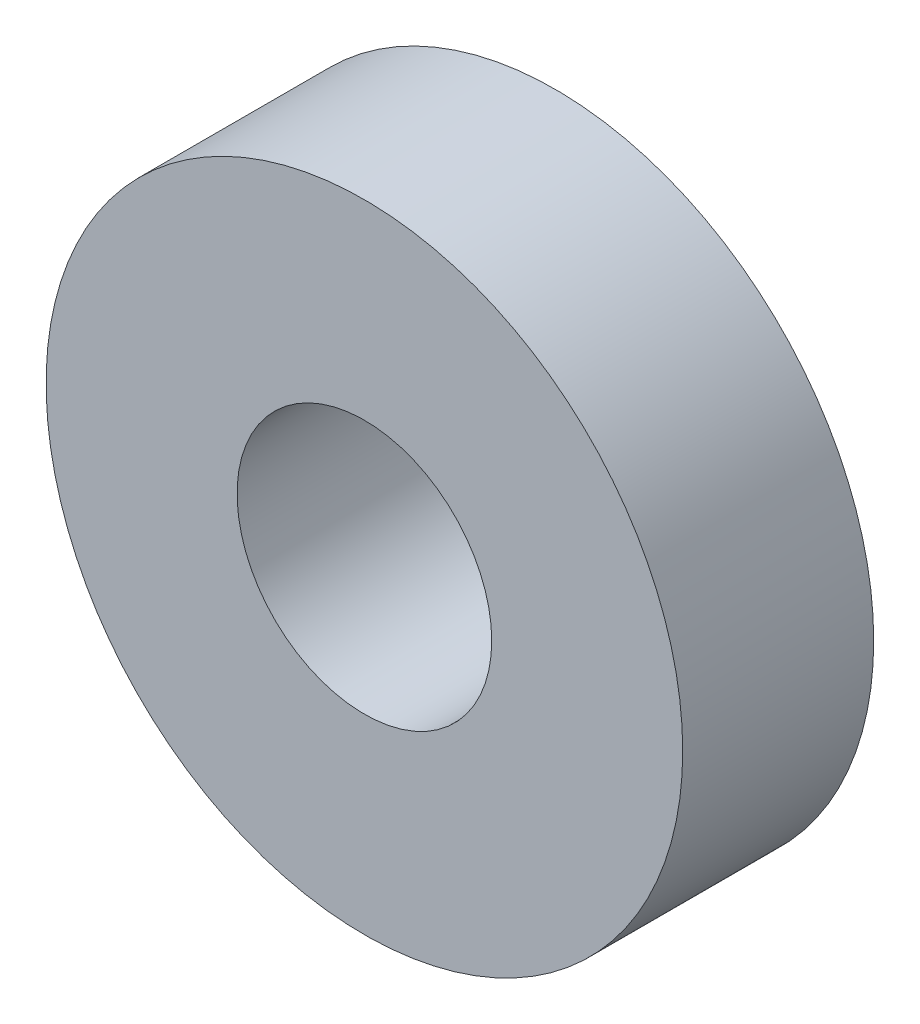
ISO-10303-21;
HEADER;
FILE_DESCRIPTION(('STEP AP214'),'2;1');
FILE_NAME('part.step','',(''),(''),'','','');
FILE_SCHEMA(('AUTOMOTIVE_DESIGN { 1 0 10303 214 1 1 1 1 }'));
ENDSEC;
DATA;
#1=APPLICATION_CONTEXT('core data for automotive mechanical design processes');
#2=APPLICATION_PROTOCOL_DEFINITION('international standard','automotive_design',2000,#1);
#3=PRODUCT_CONTEXT('',#1,'mechanical');
#4=PRODUCT('Part','Part','',(#3));
#5=PRODUCT_RELATED_PRODUCT_CATEGORY('part','',(#4));
#6=PRODUCT_DEFINITION_FORMATION('','',#4);
#7=PRODUCT_DEFINITION_CONTEXT('part definition',#1,'design');
#8=PRODUCT_DEFINITION('design','',#6,#7);
#9=PRODUCT_DEFINITION_SHAPE('','',#8);
#10=(LENGTH_UNIT() NAMED_UNIT(*) SI_UNIT(.MILLI.,.METRE.));
#11=(NAMED_UNIT(*) PLANE_ANGLE_UNIT() SI_UNIT($,.RADIAN.));
#12=(NAMED_UNIT(*) SI_UNIT($,.STERADIAN.) SOLID_ANGLE_UNIT());
#13=UNCERTAINTY_MEASURE_WITH_UNIT(LENGTH_MEASURE(1.E-05),#10,'distance_accuracy_value','');
#14=(GEOMETRIC_REPRESENTATION_CONTEXT(3) GLOBAL_UNCERTAINTY_ASSIGNED_CONTEXT((#13)) GLOBAL_UNIT_ASSIGNED_CONTEXT((#10,
#11,#12)) REPRESENTATION_CONTEXT('',''));
#15=CARTESIAN_POINT('',(0.,0.,0.));
#16=DIRECTION('',(0.,0.,1.));
#17=DIRECTION('',(1.,0.,0.));
#18=AXIS2_PLACEMENT_3D('',#15,#16,#17);
#19=CARTESIAN_POINT('',(0.,0.,6.));
#20=DIRECTION('',(0.,0.,1.));
#21=DIRECTION('',(1.,0.,0.));
#22=AXIS2_PLACEMENT_3D('',#19,#20,#21);
#23=PLANE('',#22);
#24=CARTESIAN_POINT('',(0.,0.,6.));
#25=DIRECTION('',(0.,0.,1.));
#26=DIRECTION('',(1.,0.,0.));
#27=AXIS2_PLACEMENT_3D('',#24,#25,#26);
#28=CIRCLE('',#27,10.);
#29=CARTESIAN_POINT('',(10.,0.,6.));
#30=VERTEX_POINT('',#29);
#31=EDGE_CURVE('E10',#30,#30,#28,.T.);
#32=ORIENTED_EDGE('',*,*,#31,.T.);
#33=EDGE_LOOP('',(#32));
#34=FACE_BOUND('',#33,.T.);
#35=CARTESIAN_POINT('',(0.,0.,6.));
#36=DIRECTION('',(0.,0.,1.));
#37=DIRECTION('',(1.,0.,0.));
#38=AXIS2_PLACEMENT_3D('',#35,#36,#37);
#39=CIRCLE('',#38,4.);
#40=CARTESIAN_POINT('',(4.,0.,6.));
#41=VERTEX_POINT('',#40);
#42=EDGE_CURVE('E49',#41,#41,#39,.T.);
#43=ORIENTED_EDGE('',*,*,#42,.F.);
#44=EDGE_LOOP('',(#43));
#45=FACE_BOUND('',#44,.T.);
#46=ADVANCED_FACE('F36',(#34,#45),#23,.T.);
#47=CARTESIAN_POINT('',(0.,0.,0.));
#48=DIRECTION('',(0.,0.,1.));
#49=DIRECTION('',(1.,0.,0.));
#50=AXIS2_PLACEMENT_3D('',#47,#48,#49);
#51=PLANE('',#50);
#52=CARTESIAN_POINT('',(0.,0.,0.));
#53=DIRECTION('',(0.,0.,1.));
#54=DIRECTION('',(1.,0.,0.));
#55=AXIS2_PLACEMENT_3D('',#52,#53,#54);
#56=CIRCLE('',#55,10.);
#57=CARTESIAN_POINT('',(10.,0.,0.));
#58=VERTEX_POINT('',#57);
#59=EDGE_CURVE('E40',#58,#58,#56,.T.);
#60=ORIENTED_EDGE('',*,*,#59,.F.);
#61=EDGE_LOOP('',(#60));
#62=FACE_BOUND('',#61,.T.);
#63=CARTESIAN_POINT('',(0.,0.,0.));
#64=DIRECTION('',(0.,0.,1.));
#65=DIRECTION('',(1.,0.,0.));
#66=AXIS2_PLACEMENT_3D('',#63,#64,#65);
#67=CIRCLE('',#66,4.);
#68=CARTESIAN_POINT('',(4.,0.,0.));
#69=VERTEX_POINT('',#68);
#70=EDGE_CURVE('E51',#69,#69,#67,.T.);
#71=ORIENTED_EDGE('',*,*,#70,.T.);
#72=EDGE_LOOP('',(#71));
#73=FACE_BOUND('',#72,.T.);
#74=ADVANCED_FACE('F63',(#62,#73),#51,.F.);
#75=CARTESIAN_POINT('',(0.,0.,6.));
#76=DIRECTION('',(0.,0.,-1.));
#77=DIRECTION('',(-1.,0.,0.));
#78=AXIS2_PLACEMENT_3D('',#75,#76,#77);
#79=CYLINDRICAL_SURFACE('',#78,10.);
#80=ORIENTED_EDGE('',*,*,#31,.F.);
#81=EDGE_LOOP('',(#80));
#82=FACE_BOUND('',#81,.T.);
#83=ORIENTED_EDGE('',*,*,#59,.T.);
#84=EDGE_LOOP('',(#83));
#85=FACE_BOUND('',#84,.T.);
#86=ADVANCED_FACE('F38',(#82,#85),#79,.T.);
#87=CARTESIAN_POINT('',(0.,0.,6.));
#88=DIRECTION('',(0.,0.,-1.));
#89=DIRECTION('',(-1.,0.,0.));
#90=AXIS2_PLACEMENT_3D('',#87,#88,#89);
#91=CYLINDRICAL_SURFACE('',#90,4.);
#92=ORIENTED_EDGE('',*,*,#42,.T.);
#93=EDGE_LOOP('',(#92));
#94=FACE_BOUND('',#93,.T.);
#95=ORIENTED_EDGE('',*,*,#70,.F.);
#96=EDGE_LOOP('',(#95));
#97=FACE_BOUND('',#96,.T.);
#98=ADVANCED_FACE('F59',(#94,#97),#91,.F.);
#99=CLOSED_SHELL('',(#46,#74,#86,#98));
#100=MANIFOLD_SOLID_BREP('B2',#99);
#101=ADVANCED_BREP_SHAPE_REPRESENTATION('',(#18,#100),#14);
#102=SHAPE_DEFINITION_REPRESENTATION(#9,#101);
ENDSEC;
END-ISO-10303-21;
